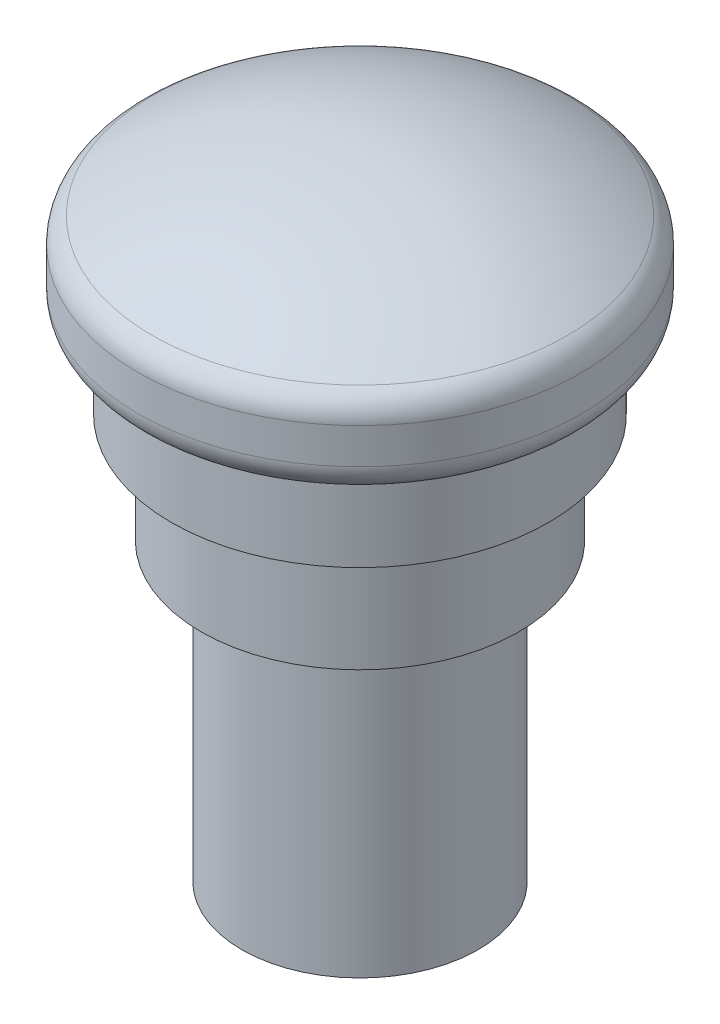
ISO-10303-21;
HEADER;
FILE_DESCRIPTION(('STEP AP214'),'2;1');
FILE_NAME('part.step','',(''),(''),'','','');
FILE_SCHEMA(('AUTOMOTIVE_DESIGN { 1 0 10303 214 1 1 1 1 }'));
ENDSEC;
DATA;
#1=APPLICATION_CONTEXT('core data for automotive mechanical design processes');
#2=APPLICATION_PROTOCOL_DEFINITION('international standard','automotive_design',2000,#1);
#3=PRODUCT_CONTEXT('',#1,'mechanical');
#4=PRODUCT('Part','Part','',(#3));
#5=PRODUCT_RELATED_PRODUCT_CATEGORY('part','',(#4));
#6=PRODUCT_DEFINITION_FORMATION('','',#4);
#7=PRODUCT_DEFINITION_CONTEXT('part definition',#1,'design');
#8=PRODUCT_DEFINITION('design','',#6,#7);
#9=PRODUCT_DEFINITION_SHAPE('','',#8);
#10=(LENGTH_UNIT() NAMED_UNIT(*) SI_UNIT(.MILLI.,.METRE.));
#11=(NAMED_UNIT(*) PLANE_ANGLE_UNIT() SI_UNIT($,.RADIAN.));
#12=(NAMED_UNIT(*) SI_UNIT($,.STERADIAN.) SOLID_ANGLE_UNIT());
#13=UNCERTAINTY_MEASURE_WITH_UNIT(LENGTH_MEASURE(1.E-05),#10,'distance_accuracy_value','');
#14=(GEOMETRIC_REPRESENTATION_CONTEXT(3) GLOBAL_UNCERTAINTY_ASSIGNED_CONTEXT((#13)) GLOBAL_UNIT_ASSIGNED_CONTEXT((#10,
#11,#12)) REPRESENTATION_CONTEXT('',''));
#15=CARTESIAN_POINT('',(0.,0.,0.));
#16=DIRECTION('',(0.,0.,1.));
#17=DIRECTION('',(1.,0.,0.));
#18=AXIS2_PLACEMENT_3D('',#15,#16,#17);
#19=CARTESIAN_POINT('',(0.,16.2434782608695,0.));
#20=DIRECTION('',(0.,1.,0.));
#21=DIRECTION('',(0.,0.,-1.));
#22=AXIS2_PLACEMENT_3D('',#19,#20,#21);
#23=SPHERICAL_SURFACE('',#22,26.7565217391305);
#24=CARTESIAN_POINT('',(0.,39.0141291079429,0.));
#25=DIRECTION('',(0.,-1.,0.));
#26=DIRECTION('',(0.,0.,-1.));
#27=AXIS2_PLACEMENT_3D('',#24,#25,#26);
#28=CIRCLE('',#27,14.0502283105023);
#29=CARTESIAN_POINT('',(0.,39.0141291079429,-14.0502283105023));
#30=VERTEX_POINT('',#29);
#31=EDGE_CURVE('E10',#30,#30,#28,.F.);
#32=ORIENTED_EDGE('',*,*,#31,.T.);
#33=EDGE_LOOP('',(#32));
#34=FACE_BOUND('',#33,.T.);
#35=ADVANCED_FACE('F31',(#34),#23,.T.);
#36=CARTESIAN_POINT('',(0.,43.,0.));
#37=DIRECTION('',(0.,1.,0.));
#38=DIRECTION('',(0.,0.,1.));
#39=AXIS2_PLACEMENT_3D('',#36,#37,#38);
#40=CYLINDRICAL_SURFACE('',#39,15.);
#41=CARTESIAN_POINT('',(0.,34.9,0.));
#42=DIRECTION('',(0.,1.,0.));
#43=DIRECTION('',(0.,0.,1.));
#44=AXIS2_PLACEMENT_3D('',#41,#42,#43);
#45=CIRCLE('',#44,15.);
#46=CARTESIAN_POINT('',(0.,34.9,15.));
#47=VERTEX_POINT('',#46);
#48=EDGE_CURVE('E42',#47,#47,#45,.T.);
#49=ORIENTED_EDGE('',*,*,#48,.T.);
#50=EDGE_LOOP('',(#49));
#51=FACE_BOUND('',#50,.T.);
#52=CARTESIAN_POINT('',(0.,37.3120655087141,0.));
#53=DIRECTION('',(0.,-1.,0.));
#54=DIRECTION('',(0.,0.,-1.));
#55=AXIS2_PLACEMENT_3D('',#52,#53,#54);
#56=CIRCLE('',#55,15.);
#57=CARTESIAN_POINT('',(0.,37.3120655087141,-15.));
#58=VERTEX_POINT('',#57);
#59=EDGE_CURVE('E46',#58,#58,#56,.T.);
#60=ORIENTED_EDGE('',*,*,#59,.T.);
#61=EDGE_LOOP('',(#60));
#62=FACE_BOUND('',#61,.T.);
#63=ADVANCED_FACE('F85',(#51,#62),#40,.T.);
#64=CARTESIAN_POINT('',(0.,32.9,-15.));
#65=DIRECTION('',(0.,1.,0.));
#66=DIRECTION('',(0.,0.,1.));
#67=AXIS2_PLACEMENT_3D('',#64,#65,#66);
#68=PLANE('',#67);
#69=CARTESIAN_POINT('',(0.,32.9,0.));
#70=DIRECTION('',(0.,1.,0.));
#71=DIRECTION('',(0.,0.,1.));
#72=AXIS2_PLACEMENT_3D('',#69,#70,#71);
#73=CIRCLE('',#72,13.);
#74=CARTESIAN_POINT('',(0.,32.9,13.));
#75=VERTEX_POINT('',#74);
#76=EDGE_CURVE('E38',#75,#75,#73,.F.);
#77=ORIENTED_EDGE('',*,*,#76,.T.);
#78=EDGE_LOOP('',(#77));
#79=FACE_BOUND('',#78,.T.);
#80=CARTESIAN_POINT('',(0.,32.9,0.));
#81=DIRECTION('',(0.,1.,0.));
#82=DIRECTION('',(0.,0.,1.));
#83=AXIS2_PLACEMENT_3D('',#80,#81,#82);
#84=CIRCLE('',#83,12.75);
#85=CARTESIAN_POINT('',(0.,32.9,12.75));
#86=VERTEX_POINT('',#85);
#87=EDGE_CURVE('E51',#86,#86,#84,.T.);
#88=ORIENTED_EDGE('',*,*,#87,.T.);
#89=EDGE_LOOP('',(#88));
#90=FACE_BOUND('',#89,.T.);
#91=ADVANCED_FACE('F90',(#79,#90),#68,.F.);
#92=CARTESIAN_POINT('',(0.,43.,0.));
#93=DIRECTION('',(0.,1.,0.));
#94=DIRECTION('',(0.,0.,1.));
#95=AXIS2_PLACEMENT_3D('',#92,#93,#94);
#96=CYLINDRICAL_SURFACE('',#95,12.75);
#97=ORIENTED_EDGE('',*,*,#87,.F.);
#98=EDGE_LOOP('',(#97));
#99=FACE_BOUND('',#98,.T.);
#100=CARTESIAN_POINT('',(0.,27.4,0.));
#101=DIRECTION('',(0.,1.,0.));
#102=DIRECTION('',(0.,0.,1.));
#103=AXIS2_PLACEMENT_3D('',#100,#101,#102);
#104=CIRCLE('',#103,12.75);
#105=CARTESIAN_POINT('',(0.,27.4,12.75));
#106=VERTEX_POINT('',#105);
#107=EDGE_CURVE('E54',#106,#106,#104,.T.);
#108=ORIENTED_EDGE('',*,*,#107,.T.);
#109=EDGE_LOOP('',(#108));
#110=FACE_BOUND('',#109,.T.);
#111=ADVANCED_FACE('F96',(#99,#110),#96,.T.);
#112=CARTESIAN_POINT('',(0.,27.4,-12.75));
#113=DIRECTION('',(0.,1.,0.));
#114=DIRECTION('',(0.,0.,1.));
#115=AXIS2_PLACEMENT_3D('',#112,#113,#114);
#116=PLANE('',#115);
#117=ORIENTED_EDGE('',*,*,#107,.F.);
#118=EDGE_LOOP('',(#117));
#119=FACE_BOUND('',#118,.T.);
#120=CARTESIAN_POINT('',(0.,27.4,0.));
#121=DIRECTION('',(0.,1.,0.));
#122=DIRECTION('',(0.,0.,1.));
#123=AXIS2_PLACEMENT_3D('',#120,#121,#122);
#124=CIRCLE('',#123,10.75);
#125=CARTESIAN_POINT('',(0.,27.4,10.75));
#126=VERTEX_POINT('',#125);
#127=EDGE_CURVE('E57',#126,#126,#124,.T.);
#128=ORIENTED_EDGE('',*,*,#127,.T.);
#129=EDGE_LOOP('',(#128));
#130=FACE_BOUND('',#129,.T.);
#131=ADVANCED_FACE('F99',(#119,#130),#116,.F.);
#132=CARTESIAN_POINT('',(0.,43.,0.));
#133=DIRECTION('',(0.,1.,0.));
#134=DIRECTION('',(0.,0.,1.));
#135=AXIS2_PLACEMENT_3D('',#132,#133,#134);
#136=CYLINDRICAL_SURFACE('',#135,10.75);
#137=ORIENTED_EDGE('',*,*,#127,.F.);
#138=EDGE_LOOP('',(#137));
#139=FACE_BOUND('',#138,.T.);
#140=CARTESIAN_POINT('',(0.,20.,0.));
#141=DIRECTION('',(0.,1.,0.));
#142=DIRECTION('',(0.,0.,1.));
#143=AXIS2_PLACEMENT_3D('',#140,#141,#142);
#144=CIRCLE('',#143,10.75);
#145=CARTESIAN_POINT('',(0.,20.,10.75));
#146=VERTEX_POINT('',#145);
#147=EDGE_CURVE('E60',#146,#146,#144,.T.);
#148=ORIENTED_EDGE('',*,*,#147,.T.);
#149=EDGE_LOOP('',(#148));
#150=FACE_BOUND('',#149,.T.);
#151=ADVANCED_FACE('F103',(#139,#150),#136,.T.);
#152=CARTESIAN_POINT('',(0.,20.,-10.75));
#153=DIRECTION('',(0.,1.,0.));
#154=DIRECTION('',(0.,0.,1.));
#155=AXIS2_PLACEMENT_3D('',#152,#153,#154);
#156=PLANE('',#155);
#157=ORIENTED_EDGE('',*,*,#147,.F.);
#158=EDGE_LOOP('',(#157));
#159=FACE_BOUND('',#158,.T.);
#160=CARTESIAN_POINT('',(0.,20.,0.));
#161=DIRECTION('',(0.,1.,0.));
#162=DIRECTION('',(0.,0.,1.));
#163=AXIS2_PLACEMENT_3D('',#160,#161,#162);
#164=CIRCLE('',#163,8.);
#165=CARTESIAN_POINT('',(0.,20.,8.));
#166=VERTEX_POINT('',#165);
#167=EDGE_CURVE('E63',#166,#166,#164,.T.);
#168=ORIENTED_EDGE('',*,*,#167,.T.);
#169=EDGE_LOOP('',(#168));
#170=FACE_BOUND('',#169,.T.);
#171=ADVANCED_FACE('F81',(#159,#170),#156,.F.);
#172=CARTESIAN_POINT('',(0.,43.,0.));
#173=DIRECTION('',(0.,1.,0.));
#174=DIRECTION('',(0.,0.,1.));
#175=AXIS2_PLACEMENT_3D('',#172,#173,#174);
#176=CYLINDRICAL_SURFACE('',#175,8.);
#177=ORIENTED_EDGE('',*,*,#167,.F.);
#178=EDGE_LOOP('',(#177));
#179=FACE_BOUND('',#178,.T.);
#180=CARTESIAN_POINT('',(0.,0.,0.));
#181=DIRECTION('',(0.,1.,0.));
#182=DIRECTION('',(0.,0.,1.));
#183=AXIS2_PLACEMENT_3D('',#180,#181,#182);
#184=CIRCLE('',#183,8.);
#185=CARTESIAN_POINT('',(0.,0.,8.));
#186=VERTEX_POINT('',#185);
#187=EDGE_CURVE('E66',#186,#186,#184,.T.);
#188=ORIENTED_EDGE('',*,*,#187,.T.);
#189=EDGE_LOOP('',(#188));
#190=FACE_BOUND('',#189,.T.);
#191=ADVANCED_FACE('F70',(#179,#190),#176,.T.);
#192=CARTESIAN_POINT('',(0.,0.,-8.));
#193=DIRECTION('',(0.,1.,0.));
#194=DIRECTION('',(0.,0.,1.));
#195=AXIS2_PLACEMENT_3D('',#192,#193,#194);
#196=PLANE('',#195);
#197=ORIENTED_EDGE('',*,*,#187,.F.);
#198=EDGE_LOOP('',(#197));
#199=FACE_BOUND('',#198,.T.);
#200=ADVANCED_FACE('F72',(#199),#196,.F.);
#201=CARTESIAN_POINT('',(0.,34.9,0.));
#202=DIRECTION('',(0.,1.,0.));
#203=DIRECTION('',(0.,0.,1.));
#204=AXIS2_PLACEMENT_3D('',#201,#202,#203);
#205=TOROIDAL_SURFACE('',#204,13.,2.);
#206=ORIENTED_EDGE('',*,*,#76,.F.);
#207=EDGE_LOOP('',(#206));
#208=FACE_BOUND('',#207,.T.);
#209=ORIENTED_EDGE('',*,*,#48,.F.);
#210=EDGE_LOOP('',(#209));
#211=FACE_BOUND('',#210,.T.);
#212=ADVANCED_FACE('F74',(#208,#211),#205,.T.);
#213=CARTESIAN_POINT('',(0.,37.3120655087141,0.));
#214=DIRECTION('',(0.,-1.,0.));
#215=DIRECTION('',(0.,0.,-1.));
#216=AXIS2_PLACEMENT_3D('',#213,#214,#215);
#217=TOROIDAL_SURFACE('',#216,13.,2.);
#218=ORIENTED_EDGE('',*,*,#59,.F.);
#219=EDGE_LOOP('',(#218));
#220=FACE_BOUND('',#219,.T.);
#221=ORIENTED_EDGE('',*,*,#31,.F.);
#222=EDGE_LOOP('',(#221));
#223=FACE_BOUND('',#222,.T.);
#224=ADVANCED_FACE('F33',(#220,#223),#217,.T.);
#225=CLOSED_SHELL('',(#35,#63,#91,#111,#131,#151,#171,#191,#200,#212,#224));
#226=MANIFOLD_SOLID_BREP('B2',#225);
#227=ADVANCED_BREP_SHAPE_REPRESENTATION('',(#18,#226),#14);
#228=SHAPE_DEFINITION_REPRESENTATION(#9,#227);
ENDSEC;
END-ISO-10303-21;
